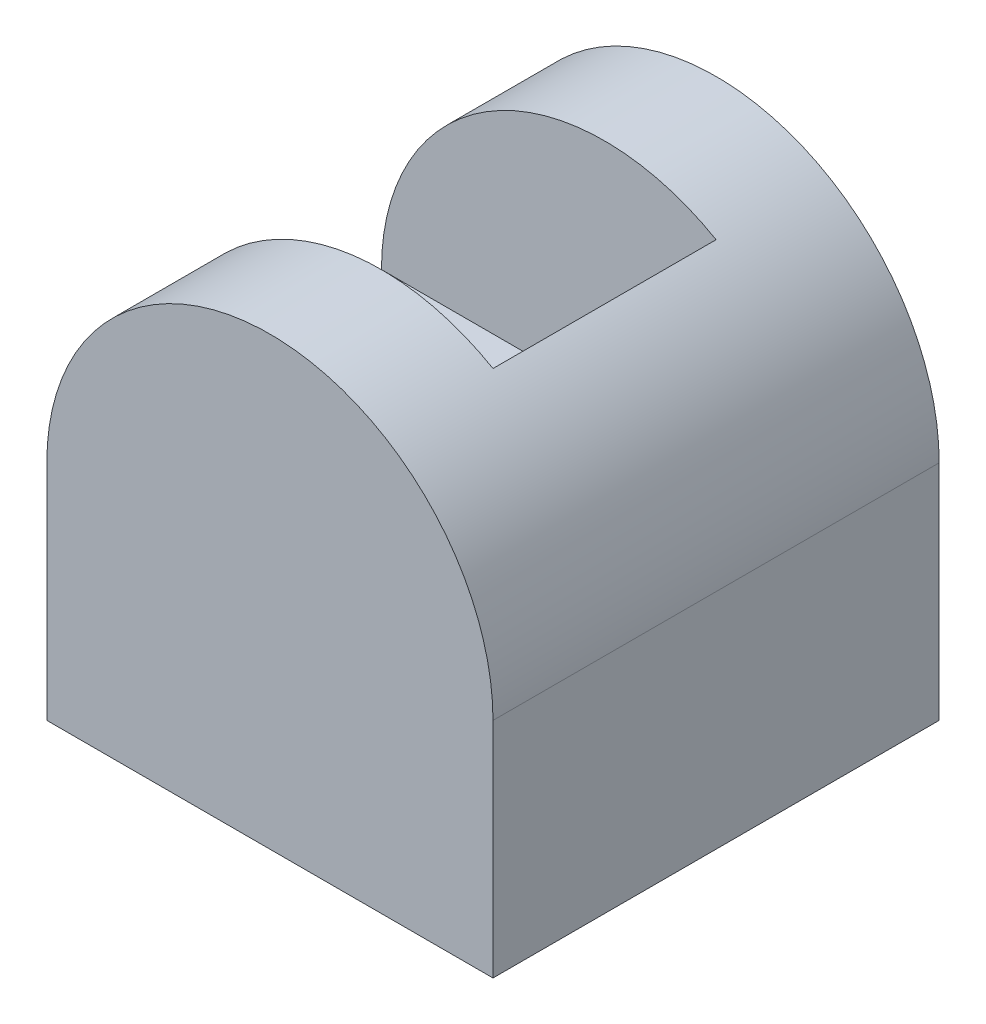
ISO-10303-21;
HEADER;
FILE_DESCRIPTION(('STEP AP214'),'2;1');
FILE_NAME('part.step','',(''),(''),'','','');
FILE_SCHEMA(('AUTOMOTIVE_DESIGN { 1 0 10303 214 1 1 1 1 }'));
ENDSEC;
DATA;
#1=APPLICATION_CONTEXT('core data for automotive mechanical design processes');
#2=APPLICATION_PROTOCOL_DEFINITION('international standard','automotive_design',2000,#1);
#3=PRODUCT_CONTEXT('',#1,'mechanical');
#4=PRODUCT('Part','Part','',(#3));
#5=PRODUCT_RELATED_PRODUCT_CATEGORY('part','',(#4));
#6=PRODUCT_DEFINITION_FORMATION('','',#4);
#7=PRODUCT_DEFINITION_CONTEXT('part definition',#1,'design');
#8=PRODUCT_DEFINITION('design','',#6,#7);
#9=PRODUCT_DEFINITION_SHAPE('','',#8);
#10=(LENGTH_UNIT() NAMED_UNIT(*) SI_UNIT(.MILLI.,.METRE.));
#11=(NAMED_UNIT(*) PLANE_ANGLE_UNIT() SI_UNIT($,.RADIAN.));
#12=(NAMED_UNIT(*) SI_UNIT($,.STERADIAN.) SOLID_ANGLE_UNIT());
#13=UNCERTAINTY_MEASURE_WITH_UNIT(LENGTH_MEASURE(1.E-05),#10,'distance_accuracy_value','');
#14=(GEOMETRIC_REPRESENTATION_CONTEXT(3) GLOBAL_UNCERTAINTY_ASSIGNED_CONTEXT((#13)) GLOBAL_UNIT_ASSIGNED_CONTEXT((#10,
#11,#12)) REPRESENTATION_CONTEXT('',''));
#15=CARTESIAN_POINT('',(0.,0.,0.));
#16=DIRECTION('',(0.,0.,1.));
#17=DIRECTION('',(1.,0.,0.));
#18=AXIS2_PLACEMENT_3D('',#15,#16,#17);
#19=CARTESIAN_POINT('',(0.,0.,40.));
#20=DIRECTION('',(0.,0.,-1.));
#21=DIRECTION('',(-1.,0.,0.));
#22=AXIS2_PLACEMENT_3D('',#19,#20,#21);
#23=PLANE('',#22);
#24=CARTESIAN_POINT('',(20.,20.,40.));
#25=DIRECTION('',(0.,0.,1.));
#26=DIRECTION('',(1.,0.,0.));
#27=AXIS2_PLACEMENT_3D('',#24,#25,#26);
#28=CIRCLE('',#27,20.);
#29=CARTESIAN_POINT('',(40.,20.,40.));
#30=VERTEX_POINT('',#29);
#31=CARTESIAN_POINT('',(0.,20.,40.));
#32=VERTEX_POINT('',#31);
#33=EDGE_CURVE('E158',#30,#32,#28,.T.);
#34=ORIENTED_EDGE('',*,*,#33,.T.);
#35=DIRECTION('',(0.,-1.,0.));
#36=VECTOR('',#35,1.);
#37=CARTESIAN_POINT('',(0.,0.,40.));
#38=LINE('',#37,#36);
#39=CARTESIAN_POINT('',(0.,0.,40.));
#40=VERTEX_POINT('',#39);
#41=EDGE_CURVE('E164',#32,#40,#38,.T.);
#42=ORIENTED_EDGE('',*,*,#41,.T.);
#43=DIRECTION('',(1.,0.,0.));
#44=VECTOR('',#43,1.);
#45=CARTESIAN_POINT('',(0.,0.,40.));
#46=LINE('',#45,#44);
#47=CARTESIAN_POINT('',(40.,0.,40.));
#48=VERTEX_POINT('',#47);
#49=EDGE_CURVE('E72',#40,#48,#46,.T.);
#50=ORIENTED_EDGE('',*,*,#49,.T.);
#51=DIRECTION('',(0.,1.,0.));
#52=VECTOR('',#51,1.);
#53=CARTESIAN_POINT('',(40.,0.,40.));
#54=LINE('',#53,#52);
#55=EDGE_CURVE('E168',#48,#30,#54,.T.);
#56=ORIENTED_EDGE('',*,*,#55,.T.);
#57=EDGE_LOOP('',(#34,#42,#50,#56));
#58=FACE_BOUND('',#57,.T.);
#59=ADVANCED_FACE('F55',(#58),#23,.F.);
#60=CARTESIAN_POINT('',(0.,0.,0.));
#61=DIRECTION('',(0.,0.,-1.));
#62=DIRECTION('',(-1.,0.,0.));
#63=AXIS2_PLACEMENT_3D('',#60,#61,#62);
#64=PLANE('',#63);
#65=CARTESIAN_POINT('',(20.,20.,0.));
#66=DIRECTION('',(0.,0.,1.));
#67=DIRECTION('',(1.,0.,0.));
#68=AXIS2_PLACEMENT_3D('',#65,#66,#67);
#69=CIRCLE('',#68,20.);
#70=CARTESIAN_POINT('',(40.,20.,0.));
#71=VERTEX_POINT('',#70);
#72=CARTESIAN_POINT('',(0.,20.,0.));
#73=VERTEX_POINT('',#72);
#74=EDGE_CURVE('E93',#71,#73,#69,.T.);
#75=ORIENTED_EDGE('',*,*,#74,.F.);
#76=DIRECTION('',(0.,1.,0.));
#77=VECTOR('',#76,1.);
#78=CARTESIAN_POINT('',(40.,0.,0.));
#79=LINE('',#78,#77);
#80=CARTESIAN_POINT('',(40.,0.,0.));
#81=VERTEX_POINT('',#80);
#82=EDGE_CURVE('E166',#81,#71,#79,.T.);
#83=ORIENTED_EDGE('',*,*,#82,.F.);
#84=DIRECTION('',(1.,0.,0.));
#85=VECTOR('',#84,1.);
#86=CARTESIAN_POINT('',(0.,0.,0.));
#87=LINE('',#86,#85);
#88=CARTESIAN_POINT('',(0.,0.,0.));
#89=VERTEX_POINT('',#88);
#90=EDGE_CURVE('E171',#89,#81,#87,.T.);
#91=ORIENTED_EDGE('',*,*,#90,.F.);
#92=DIRECTION('',(0.,-1.,0.));
#93=VECTOR('',#92,1.);
#94=CARTESIAN_POINT('',(0.,0.,0.));
#95=LINE('',#94,#93);
#96=EDGE_CURVE('E83',#73,#89,#95,.T.);
#97=ORIENTED_EDGE('',*,*,#96,.F.);
#98=EDGE_LOOP('',(#75,#83,#91,#97));
#99=FACE_BOUND('',#98,.T.);
#100=ADVANCED_FACE('F181',(#99),#64,.T.);
#101=CARTESIAN_POINT('',(0.,0.,40.));
#102=DIRECTION('',(1.,0.,0.));
#103=DIRECTION('',(0.,0.,-1.));
#104=AXIS2_PLACEMENT_3D('',#101,#102,#103);
#105=PLANE('',#104);
#106=DIRECTION('',(0.,0.,1.));
#107=VECTOR('',#106,1.);
#108=CARTESIAN_POINT('',(0.,20.,0.));
#109=LINE('',#108,#107);
#110=CARTESIAN_POINT('',(0.,20.,10.));
#111=VERTEX_POINT('',#110);
#112=EDGE_CURVE('E162',#73,#111,#109,.T.);
#113=ORIENTED_EDGE('',*,*,#112,.F.);
#114=ORIENTED_EDGE('',*,*,#96,.T.);
#115=DIRECTION('',(0.,0.,-1.));
#116=VECTOR('',#115,1.);
#117=CARTESIAN_POINT('',(0.,0.,40.));
#118=LINE('',#117,#116);
#119=EDGE_CURVE('E12',#40,#89,#118,.T.);
#120=ORIENTED_EDGE('',*,*,#119,.F.);
#121=ORIENTED_EDGE('',*,*,#41,.F.);
#122=CARTESIAN_POINT('',(0.,20.,30.));
#123=VERTEX_POINT('',#122);
#124=EDGE_CURVE('E160',#123,#32,#109,.T.);
#125=ORIENTED_EDGE('',*,*,#124,.F.);
#126=DIRECTION('',(0.,0.,-1.));
#127=VECTOR('',#126,1.);
#128=CARTESIAN_POINT('',(0.,20.,30.));
#129=LINE('',#128,#127);
#130=EDGE_CURVE('E152',#123,#111,#129,.T.);
#131=ORIENTED_EDGE('',*,*,#130,.T.);
#132=EDGE_LOOP('',(#113,#114,#120,#121,#125,#131));
#133=FACE_BOUND('',#132,.T.);
#134=ADVANCED_FACE('F57',(#133),#105,.F.);
#135=CARTESIAN_POINT('',(0.,0.,40.));
#136=DIRECTION('',(0.,1.,0.));
#137=DIRECTION('',(0.,0.,1.));
#138=AXIS2_PLACEMENT_3D('',#135,#136,#137);
#139=PLANE('',#138);
#140=ORIENTED_EDGE('',*,*,#90,.T.);
#141=DIRECTION('',(0.,0.,-1.));
#142=VECTOR('',#141,1.);
#143=CARTESIAN_POINT('',(40.,0.,40.));
#144=LINE('',#143,#142);
#145=EDGE_CURVE('E64',#48,#81,#144,.T.);
#146=ORIENTED_EDGE('',*,*,#145,.F.);
#147=ORIENTED_EDGE('',*,*,#49,.F.);
#148=ORIENTED_EDGE('',*,*,#119,.T.);
#149=EDGE_LOOP('',(#140,#146,#147,#148));
#150=FACE_BOUND('',#149,.T.);
#151=ADVANCED_FACE('F183',(#150),#139,.F.);
#152=CARTESIAN_POINT('',(40.,0.,40.));
#153=DIRECTION('',(-1.,0.,0.));
#154=DIRECTION('',(0.,0.,1.));
#155=AXIS2_PLACEMENT_3D('',#152,#153,#154);
#156=PLANE('',#155);
#157=ORIENTED_EDGE('',*,*,#82,.T.);
#158=DIRECTION('',(0.,0.,1.));
#159=VECTOR('',#158,1.);
#160=CARTESIAN_POINT('',(40.,20.,0.));
#161=LINE('',#160,#159);
#162=EDGE_CURVE('E155',#71,#30,#161,.T.);
#163=ORIENTED_EDGE('',*,*,#162,.T.);
#164=ORIENTED_EDGE('',*,*,#55,.F.);
#165=ORIENTED_EDGE('',*,*,#145,.T.);
#166=EDGE_LOOP('',(#157,#163,#164,#165));
#167=FACE_BOUND('',#166,.T.);
#168=ADVANCED_FACE('F178',(#167),#156,.F.);
#169=CARTESIAN_POINT('',(20.,20.,0.));
#170=DIRECTION('',(0.,0.,1.));
#171=DIRECTION('',(1.,0.,0.));
#172=AXIS2_PLACEMENT_3D('',#169,#170,#171);
#173=CYLINDRICAL_SURFACE('',#172,20.);
#174=DIRECTION('',(0.,0.,-1.));
#175=VECTOR('',#174,1.);
#176=CARTESIAN_POINT('',(30.,37.3205080756888,30.));
#177=LINE('',#176,#175);
#178=CARTESIAN_POINT('',(30.,37.3205080756888,30.));
#179=VERTEX_POINT('',#178);
#180=CARTESIAN_POINT('',(30.,37.3205080756888,10.));
#181=VERTEX_POINT('',#180);
#182=EDGE_CURVE('E119',#179,#181,#177,.T.);
#183=ORIENTED_EDGE('',*,*,#182,.F.);
#184=CARTESIAN_POINT('',(20.,20.,30.));
#185=DIRECTION('',(0.,0.,1.));
#186=DIRECTION('',(1.,0.,0.));
#187=AXIS2_PLACEMENT_3D('',#184,#185,#186);
#188=CIRCLE('',#187,20.);
#189=EDGE_CURVE('E124',#179,#123,#188,.T.);
#190=ORIENTED_EDGE('',*,*,#189,.T.);
#191=ORIENTED_EDGE('',*,*,#124,.T.);
#192=ORIENTED_EDGE('',*,*,#33,.F.);
#193=ORIENTED_EDGE('',*,*,#162,.F.);
#194=ORIENTED_EDGE('',*,*,#74,.T.);
#195=ORIENTED_EDGE('',*,*,#112,.T.);
#196=CARTESIAN_POINT('',(20.,20.,10.));
#197=DIRECTION('',(0.,0.,1.));
#198=DIRECTION('',(1.,0.,0.));
#199=AXIS2_PLACEMENT_3D('',#196,#197,#198);
#200=CIRCLE('',#199,20.);
#201=EDGE_CURVE('E126',#181,#111,#200,.T.);
#202=ORIENTED_EDGE('',*,*,#201,.F.);
#203=EDGE_LOOP('',(#183,#190,#191,#192,#193,#194,#195,#202));
#204=FACE_BOUND('',#203,.T.);
#205=ADVANCED_FACE('F121',(#204),#173,.T.);
#206=CARTESIAN_POINT('',(0.,20.,30.));
#207=DIRECTION('',(0.,1.,0.));
#208=DIRECTION('',(0.,0.,1.));
#209=AXIS2_PLACEMENT_3D('',#206,#207,#208);
#210=PLANE('',#209);
#211=DIRECTION('',(1.,0.,0.));
#212=VECTOR('',#211,1.);
#213=CARTESIAN_POINT('',(0.,20.,10.));
#214=LINE('',#213,#212);
#215=CARTESIAN_POINT('',(20.,20.,10.));
#216=VERTEX_POINT('',#215);
#217=EDGE_CURVE('E143',#111,#216,#214,.T.);
#218=ORIENTED_EDGE('',*,*,#217,.F.);
#219=ORIENTED_EDGE('',*,*,#130,.F.);
#220=DIRECTION('',(1.,0.,0.));
#221=VECTOR('',#220,1.);
#222=CARTESIAN_POINT('',(0.,20.,30.));
#223=LINE('',#222,#221);
#224=CARTESIAN_POINT('',(20.,20.,30.));
#225=VERTEX_POINT('',#224);
#226=EDGE_CURVE('E141',#123,#225,#223,.T.);
#227=ORIENTED_EDGE('',*,*,#226,.T.);
#228=DIRECTION('',(0.,0.,-1.));
#229=VECTOR('',#228,1.);
#230=CARTESIAN_POINT('',(20.,20.,30.));
#231=LINE('',#230,#229);
#232=EDGE_CURVE('E134',#225,#216,#231,.T.);
#233=ORIENTED_EDGE('',*,*,#232,.T.);
#234=EDGE_LOOP('',(#218,#219,#227,#233));
#235=FACE_BOUND('',#234,.T.);
#236=ADVANCED_FACE('F199',(#235),#210,.T.);
#237=CARTESIAN_POINT('',(20.,20.,30.));
#238=DIRECTION('',(0.,0.,1.));
#239=DIRECTION('',(1.,0.,0.));
#240=AXIS2_PLACEMENT_3D('',#237,#238,#239);
#241=PLANE('',#240);
#242=ORIENTED_EDGE('',*,*,#189,.F.);
#243=DIRECTION('',(0.500000000000001,0.866025403784438,0.));
#244=VECTOR('',#243,1.);
#245=CARTESIAN_POINT('',(6.33974596215558,-3.66025403784438,30.));
#246=LINE('',#245,#244);
#247=EDGE_CURVE('E129',#225,#179,#246,.T.);
#248=ORIENTED_EDGE('',*,*,#247,.F.);
#249=ORIENTED_EDGE('',*,*,#226,.F.);
#250=EDGE_LOOP('',(#242,#248,#249));
#251=FACE_BOUND('',#250,.T.);
#252=ADVANCED_FACE('F140',(#251),#241,.F.);
#253=CARTESIAN_POINT('',(20.,20.,10.));
#254=DIRECTION('',(0.,0.,1.));
#255=DIRECTION('',(1.,0.,0.));
#256=AXIS2_PLACEMENT_3D('',#253,#254,#255);
#257=PLANE('',#256);
#258=DIRECTION('',(0.500000000000001,0.866025403784438,0.));
#259=VECTOR('',#258,1.);
#260=CARTESIAN_POINT('',(6.33974596215558,-3.66025403784438,10.));
#261=LINE('',#260,#259);
#262=EDGE_CURVE('E138',#216,#181,#261,.T.);
#263=ORIENTED_EDGE('',*,*,#262,.T.);
#264=ORIENTED_EDGE('',*,*,#201,.T.);
#265=ORIENTED_EDGE('',*,*,#217,.T.);
#266=EDGE_LOOP('',(#263,#264,#265));
#267=FACE_BOUND('',#266,.T.);
#268=ADVANCED_FACE('F203',(#267),#257,.T.);
#269=CARTESIAN_POINT('',(6.33974596215558,-3.66025403784438,30.));
#270=DIRECTION('',(-0.866025403784438,0.500000000000001,0.));
#271=DIRECTION('',(-0.500000000000001,-0.866025403784438,0.));
#272=AXIS2_PLACEMENT_3D('',#269,#270,#271);
#273=PLANE('',#272);
#274=ORIENTED_EDGE('',*,*,#262,.F.);
#275=ORIENTED_EDGE('',*,*,#232,.F.);
#276=ORIENTED_EDGE('',*,*,#247,.T.);
#277=ORIENTED_EDGE('',*,*,#182,.T.);
#278=EDGE_LOOP('',(#274,#275,#276,#277));
#279=FACE_BOUND('',#278,.T.);
#280=ADVANCED_FACE('F132',(#279),#273,.T.);
#281=CLOSED_SHELL('',(#59,#100,#134,#151,#168,#205,#236,#252,#268,#280));
#282=MANIFOLD_SOLID_BREP('B2',#281);
#283=ADVANCED_BREP_SHAPE_REPRESENTATION('',(#18,#282),#14);
#284=SHAPE_DEFINITION_REPRESENTATION(#9,#283);
ENDSEC;
END-ISO-10303-21;
